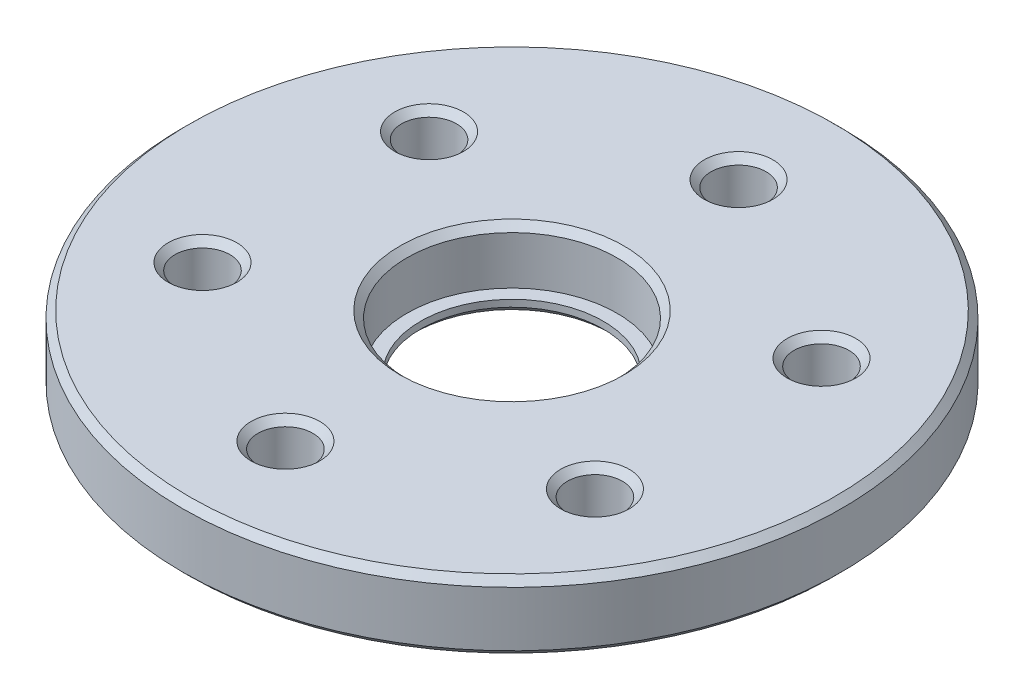
ISO-10303-21;
HEADER;
FILE_DESCRIPTION(('STEP AP214'),'2;1');
FILE_NAME('part.step','',(''),(''),'','','');
FILE_SCHEMA(('AUTOMOTIVE_DESIGN { 1 0 10303 214 1 1 1 1 }'));
ENDSEC;
DATA;
#1=APPLICATION_CONTEXT('core data for automotive mechanical design processes');
#2=APPLICATION_PROTOCOL_DEFINITION('international standard','automotive_design',2000,#1);
#3=PRODUCT_CONTEXT('',#1,'mechanical');
#4=PRODUCT('Part','Part','',(#3));
#5=PRODUCT_RELATED_PRODUCT_CATEGORY('part','',(#4));
#6=PRODUCT_DEFINITION_FORMATION('','',#4);
#7=PRODUCT_DEFINITION_CONTEXT('part definition',#1,'design');
#8=PRODUCT_DEFINITION('design','',#6,#7);
#9=PRODUCT_DEFINITION_SHAPE('','',#8);
#10=(LENGTH_UNIT() NAMED_UNIT(*) SI_UNIT(.MILLI.,.METRE.));
#11=(NAMED_UNIT(*) PLANE_ANGLE_UNIT() SI_UNIT($,.RADIAN.));
#12=(NAMED_UNIT(*) SI_UNIT($,.STERADIAN.) SOLID_ANGLE_UNIT());
#13=UNCERTAINTY_MEASURE_WITH_UNIT(LENGTH_MEASURE(1.E-05),#10,'distance_accuracy_value','');
#14=(GEOMETRIC_REPRESENTATION_CONTEXT(3) GLOBAL_UNCERTAINTY_ASSIGNED_CONTEXT((#13)) GLOBAL_UNIT_ASSIGNED_CONTEXT((#10,
#11,#12)) REPRESENTATION_CONTEXT('',''));
#15=CARTESIAN_POINT('',(0.,0.,0.));
#16=DIRECTION('',(0.,0.,1.));
#17=DIRECTION('',(1.,0.,0.));
#18=AXIS2_PLACEMENT_3D('',#15,#16,#17);
#19=CARTESIAN_POINT('',(0.,4.,0.));
#20=DIRECTION('',(0.,1.,0.));
#21=DIRECTION('',(0.,0.,1.));
#22=AXIS2_PLACEMENT_3D('',#19,#20,#21);
#23=PLANE('',#22);
#24=CARTESIAN_POINT('',(0.,4.,0.));
#25=DIRECTION('',(0.,1.,0.));
#26=DIRECTION('',(0.,0.,1.));
#27=AXIS2_PLACEMENT_3D('',#24,#25,#26);
#28=CIRCLE('',#27,8.15000000000001);
#29=CARTESIAN_POINT('',(0.,4.,8.15000000000001));
#30=VERTEX_POINT('',#29);
#31=EDGE_CURVE('E10',#30,#30,#28,.F.);
#32=ORIENTED_EDGE('',*,*,#31,.T.);
#33=EDGE_LOOP('',(#32));
#34=FACE_BOUND('',#33,.T.);
#35=CARTESIAN_POINT('',(0.,4.,0.));
#36=DIRECTION('',(0.,1.,0.));
#37=DIRECTION('',(0.,0.,1.));
#38=AXIS2_PLACEMENT_3D('',#35,#36,#37);
#39=CIRCLE('',#38,23.5);
#40=CARTESIAN_POINT('',(0.,4.,23.5));
#41=VERTEX_POINT('',#40);
#42=EDGE_CURVE('E47',#41,#41,#39,.T.);
#43=ORIENTED_EDGE('',*,*,#42,.T.);
#44=EDGE_LOOP('',(#43));
#45=FACE_BOUND('',#44,.T.);
#46=CARTESIAN_POINT('',(0.,4.,-16.5));
#47=DIRECTION('',(0.,1.,0.));
#48=DIRECTION('',(0.,0.,1.));
#49=AXIS2_PLACEMENT_3D('',#46,#47,#48);
#50=CIRCLE('',#49,2.5);
#51=CARTESIAN_POINT('',(0.,4.,-14.));
#52=VERTEX_POINT('',#51);
#53=EDGE_CURVE('E51',#52,#52,#50,.F.);
#54=ORIENTED_EDGE('',*,*,#53,.T.);
#55=EDGE_LOOP('',(#54));
#56=FACE_BOUND('',#55,.T.);
#57=CARTESIAN_POINT('',(-14.2894191624433,4.,-8.24999999999997));
#58=DIRECTION('',(0.,1.,0.));
#59=DIRECTION('',(0.,0.,1.));
#60=AXIS2_PLACEMENT_3D('',#57,#58,#59);
#61=CIRCLE('',#60,2.49999999999999);
#62=CARTESIAN_POINT('',(-14.2894191624433,4.,-5.74999999999998));
#63=VERTEX_POINT('',#62);
#64=EDGE_CURVE('E55',#63,#63,#61,.F.);
#65=ORIENTED_EDGE('',*,*,#64,.T.);
#66=EDGE_LOOP('',(#65));
#67=FACE_BOUND('',#66,.T.);
#68=CARTESIAN_POINT('',(-14.2894191624432,4.,8.25000000000007));
#69=DIRECTION('',(0.,1.,0.));
#70=DIRECTION('',(0.,0.,1.));
#71=AXIS2_PLACEMENT_3D('',#68,#69,#70);
#72=CIRCLE('',#71,2.50000000000001);
#73=CARTESIAN_POINT('',(-14.2894191624432,4.,10.7500000000001));
#74=VERTEX_POINT('',#73);
#75=EDGE_CURVE('E60',#74,#74,#72,.F.);
#76=ORIENTED_EDGE('',*,*,#75,.T.);
#77=EDGE_LOOP('',(#76));
#78=FACE_BOUND('',#77,.T.);
#79=CARTESIAN_POINT('',(0.,4.,16.5));
#80=DIRECTION('',(0.,1.,0.));
#81=DIRECTION('',(0.,0.,1.));
#82=AXIS2_PLACEMENT_3D('',#79,#80,#81);
#83=CIRCLE('',#82,2.5);
#84=CARTESIAN_POINT('',(0.,4.,19.));
#85=VERTEX_POINT('',#84);
#86=EDGE_CURVE('E63',#85,#85,#83,.F.);
#87=ORIENTED_EDGE('',*,*,#86,.T.);
#88=EDGE_LOOP('',(#87));
#89=FACE_BOUND('',#88,.T.);
#90=CARTESIAN_POINT('',(14.2894191624433,4.,8.24999999999987));
#91=DIRECTION('',(0.,1.,0.));
#92=DIRECTION('',(0.,0.,1.));
#93=AXIS2_PLACEMENT_3D('',#90,#91,#92);
#94=CIRCLE('',#93,2.50000000000002);
#95=CARTESIAN_POINT('',(14.2894191624433,4.,10.7499999999999));
#96=VERTEX_POINT('',#95);
#97=EDGE_CURVE('E66',#96,#96,#94,.F.);
#98=ORIENTED_EDGE('',*,*,#97,.T.);
#99=EDGE_LOOP('',(#98));
#100=FACE_BOUND('',#99,.T.);
#101=CARTESIAN_POINT('',(14.2894191624431,4.,-8.25000000000017));
#102=DIRECTION('',(0.,1.,0.));
#103=DIRECTION('',(0.,0.,1.));
#104=AXIS2_PLACEMENT_3D('',#101,#102,#103);
#105=CIRCLE('',#104,2.50000000000002);
#106=CARTESIAN_POINT('',(14.2894191624431,4.,-5.75000000000015));
#107=VERTEX_POINT('',#106);
#108=EDGE_CURVE('E69',#107,#107,#105,.F.);
#109=ORIENTED_EDGE('',*,*,#108,.T.);
#110=EDGE_LOOP('',(#109));
#111=FACE_BOUND('',#110,.T.);
#112=ADVANCED_FACE('F39',(#34,#45,#56,#67,#78,#89,#100,#111),#23,.T.);
#113=CARTESIAN_POINT('',(0.,4.,0.));
#114=DIRECTION('',(0.,-1.,0.));
#115=DIRECTION('',(0.,0.,-1.));
#116=AXIS2_PLACEMENT_3D('',#113,#114,#115);
#117=CYLINDRICAL_SURFACE('',#116,24.);
#118=CARTESIAN_POINT('',(0.,-0.499999999999996,0.));
#119=DIRECTION('',(0.,1.,0.));
#120=DIRECTION('',(0.,0.,1.));
#121=AXIS2_PLACEMENT_3D('',#118,#119,#120);
#122=CIRCLE('',#121,24.);
#123=CARTESIAN_POINT('',(0.,-0.499999999999996,24.));
#124=VERTEX_POINT('',#123);
#125=EDGE_CURVE('E138',#124,#124,#122,.T.);
#126=ORIENTED_EDGE('',*,*,#125,.T.);
#127=EDGE_LOOP('',(#126));
#128=FACE_BOUND('',#127,.T.);
#129=CARTESIAN_POINT('',(0.,3.5,0.));
#130=DIRECTION('',(0.,1.,0.));
#131=DIRECTION('',(0.,0.,1.));
#132=AXIS2_PLACEMENT_3D('',#129,#130,#131);
#133=CIRCLE('',#132,24.);
#134=CARTESIAN_POINT('',(0.,3.5,24.));
#135=VERTEX_POINT('',#134);
#136=EDGE_CURVE('E141',#135,#135,#133,.F.);
#137=ORIENTED_EDGE('',*,*,#136,.T.);
#138=EDGE_LOOP('',(#137));
#139=FACE_BOUND('',#138,.T.);
#140=ADVANCED_FACE('F164',(#128,#139),#117,.T.);
#141=CARTESIAN_POINT('',(0.,4.,0.));
#142=DIRECTION('',(0.,-1.,0.));
#143=DIRECTION('',(0.,0.,-1.));
#144=AXIS2_PLACEMENT_3D('',#141,#142,#143);
#145=CYLINDRICAL_SURFACE('',#144,7.65);
#146=CARTESIAN_POINT('',(0.,3.5,0.));
#147=DIRECTION('',(0.,1.,0.));
#148=DIRECTION('',(0.,0.,1.));
#149=AXIS2_PLACEMENT_3D('',#146,#147,#148);
#150=CIRCLE('',#149,7.65);
#151=CARTESIAN_POINT('',(0.,3.5,7.65));
#152=VERTEX_POINT('',#151);
#153=EDGE_CURVE('E72',#152,#152,#150,.T.);
#154=ORIENTED_EDGE('',*,*,#153,.T.);
#155=EDGE_LOOP('',(#154));
#156=FACE_BOUND('',#155,.T.);
#157=CARTESIAN_POINT('',(0.,0.,0.));
#158=DIRECTION('',(0.,1.,0.));
#159=DIRECTION('',(0.,0.,1.));
#160=AXIS2_PLACEMENT_3D('',#157,#158,#159);
#161=CIRCLE('',#160,7.65);
#162=CARTESIAN_POINT('',(0.,0.,7.65));
#163=VERTEX_POINT('',#162);
#164=EDGE_CURVE('E144',#163,#163,#161,.T.);
#165=ORIENTED_EDGE('',*,*,#164,.F.);
#166=EDGE_LOOP('',(#165));
#167=FACE_BOUND('',#166,.T.);
#168=ADVANCED_FACE('F161',(#156,#167),#145,.F.);
#169=CARTESIAN_POINT('',(0.,0.,-16.5));
#170=DIRECTION('',(0.,1.,0.));
#171=DIRECTION('',(0.,0.,1.));
#172=AXIS2_PLACEMENT_3D('',#169,#170,#171);
#173=CYLINDRICAL_SURFACE('',#172,2.);
#174=CARTESIAN_POINT('',(0.,-0.500000000000005,-16.5));
#175=DIRECTION('',(0.,1.,0.));
#176=DIRECTION('',(0.,0.,1.));
#177=AXIS2_PLACEMENT_3D('',#174,#175,#176);
#178=CIRCLE('',#177,2.);
#179=CARTESIAN_POINT('',(0.,-0.500000000000005,-14.5));
#180=VERTEX_POINT('',#179);
#181=EDGE_CURVE('E81',#180,#180,#178,.F.);
#182=ORIENTED_EDGE('',*,*,#181,.T.);
#183=EDGE_LOOP('',(#182));
#184=FACE_BOUND('',#183,.T.);
#185=CARTESIAN_POINT('',(0.,3.50000000000001,-16.5));
#186=DIRECTION('',(0.,1.,0.));
#187=DIRECTION('',(0.,0.,1.));
#188=AXIS2_PLACEMENT_3D('',#185,#186,#187);
#189=CIRCLE('',#188,2.);
#190=CARTESIAN_POINT('',(0.,3.50000000000001,-14.5));
#191=VERTEX_POINT('',#190);
#192=EDGE_CURVE('E84',#191,#191,#189,.T.);
#193=ORIENTED_EDGE('',*,*,#192,.T.);
#194=EDGE_LOOP('',(#193));
#195=FACE_BOUND('',#194,.T.);
#196=ADVANCED_FACE('F163',(#184,#195),#173,.F.);
#197=CARTESIAN_POINT('',(-14.2894191624433,0.,-8.24999999999997));
#198=DIRECTION('',(0.,1.,0.));
#199=DIRECTION('',(0.,0.,1.));
#200=AXIS2_PLACEMENT_3D('',#197,#198,#199);
#201=CYLINDRICAL_SURFACE('',#200,2.);
#202=CARTESIAN_POINT('',(-14.2894191624433,-0.499999999999999,-8.24999999999997));
#203=DIRECTION('',(0.,1.,0.));
#204=DIRECTION('',(0.,0.,1.));
#205=AXIS2_PLACEMENT_3D('',#202,#203,#204);
#206=CIRCLE('',#205,2.);
#207=CARTESIAN_POINT('',(-14.2894191624433,-0.499999999999999,-6.24999999999997));
#208=VERTEX_POINT('',#207);
#209=EDGE_CURVE('E75',#208,#208,#206,.F.);
#210=ORIENTED_EDGE('',*,*,#209,.T.);
#211=EDGE_LOOP('',(#210));
#212=FACE_BOUND('',#211,.T.);
#213=CARTESIAN_POINT('',(-14.2894191624433,3.50000000000001,-8.24999999999997));
#214=DIRECTION('',(0.,1.,0.));
#215=DIRECTION('',(0.,0.,1.));
#216=AXIS2_PLACEMENT_3D('',#213,#214,#215);
#217=CIRCLE('',#216,2.);
#218=CARTESIAN_POINT('',(-14.2894191624433,3.50000000000001,-6.24999999999997));
#219=VERTEX_POINT('',#218);
#220=EDGE_CURVE('E78',#219,#219,#217,.T.);
#221=ORIENTED_EDGE('',*,*,#220,.T.);
#222=EDGE_LOOP('',(#221));
#223=FACE_BOUND('',#222,.T.);
#224=ADVANCED_FACE('F171',(#212,#223),#201,.F.);
#225=CARTESIAN_POINT('',(-14.2894191624432,0.,8.25000000000007));
#226=DIRECTION('',(0.,1.,0.));
#227=DIRECTION('',(0.,0.,1.));
#228=AXIS2_PLACEMENT_3D('',#225,#226,#227);
#229=CYLINDRICAL_SURFACE('',#228,2.);
#230=CARTESIAN_POINT('',(-14.2894191624432,-0.499999999999985,8.25000000000007));
#231=DIRECTION('',(0.,1.,0.));
#232=DIRECTION('',(0.,0.,1.));
#233=AXIS2_PLACEMENT_3D('',#230,#231,#232);
#234=CIRCLE('',#233,2.);
#235=CARTESIAN_POINT('',(-14.2894191624432,-0.499999999999985,10.2500000000001));
#236=VERTEX_POINT('',#235);
#237=EDGE_CURVE('E108',#236,#236,#234,.F.);
#238=ORIENTED_EDGE('',*,*,#237,.T.);
#239=EDGE_LOOP('',(#238));
#240=FACE_BOUND('',#239,.T.);
#241=CARTESIAN_POINT('',(-14.2894191624432,3.5,8.25000000000007));
#242=DIRECTION('',(0.,1.,0.));
#243=DIRECTION('',(0.,0.,1.));
#244=AXIS2_PLACEMENT_3D('',#241,#242,#243);
#245=CIRCLE('',#244,2.);
#246=CARTESIAN_POINT('',(-14.2894191624432,3.5,10.2500000000001));
#247=VERTEX_POINT('',#246);
#248=EDGE_CURVE('E111',#247,#247,#245,.T.);
#249=ORIENTED_EDGE('',*,*,#248,.T.);
#250=EDGE_LOOP('',(#249));
#251=FACE_BOUND('',#250,.T.);
#252=ADVANCED_FACE('F303',(#240,#251),#229,.F.);
#253=CARTESIAN_POINT('',(0.,0.,16.5));
#254=DIRECTION('',(0.,1.,0.));
#255=DIRECTION('',(0.,0.,1.));
#256=AXIS2_PLACEMENT_3D('',#253,#254,#255);
#257=CYLINDRICAL_SURFACE('',#256,2.);
#258=CARTESIAN_POINT('',(0.,-0.499999999999999,16.5));
#259=DIRECTION('',(0.,1.,0.));
#260=DIRECTION('',(0.,0.,1.));
#261=AXIS2_PLACEMENT_3D('',#258,#259,#260);
#262=CIRCLE('',#261,2.);
#263=CARTESIAN_POINT('',(0.,-0.499999999999999,18.5));
#264=VERTEX_POINT('',#263);
#265=EDGE_CURVE('E99',#264,#264,#262,.F.);
#266=ORIENTED_EDGE('',*,*,#265,.T.);
#267=EDGE_LOOP('',(#266));
#268=FACE_BOUND('',#267,.T.);
#269=CARTESIAN_POINT('',(0.,3.50000000000001,16.5));
#270=DIRECTION('',(0.,1.,0.));
#271=DIRECTION('',(0.,0.,1.));
#272=AXIS2_PLACEMENT_3D('',#269,#270,#271);
#273=CIRCLE('',#272,2.);
#274=CARTESIAN_POINT('',(0.,3.50000000000001,18.5));
#275=VERTEX_POINT('',#274);
#276=EDGE_CURVE('E102',#275,#275,#273,.T.);
#277=ORIENTED_EDGE('',*,*,#276,.T.);
#278=EDGE_LOOP('',(#277));
#279=FACE_BOUND('',#278,.T.);
#280=ADVANCED_FACE('F294',(#268,#279),#257,.F.);
#281=CARTESIAN_POINT('',(14.2894191624433,0.,8.24999999999987));
#282=DIRECTION('',(0.,1.,0.));
#283=DIRECTION('',(0.,0.,1.));
#284=AXIS2_PLACEMENT_3D('',#281,#282,#283);
#285=CYLINDRICAL_SURFACE('',#284,2.);
#286=CARTESIAN_POINT('',(14.2894191624433,-0.499999999999999,8.24999999999987));
#287=DIRECTION('',(0.,1.,0.));
#288=DIRECTION('',(0.,0.,1.));
#289=AXIS2_PLACEMENT_3D('',#286,#287,#288);
#290=CIRCLE('',#289,2.);
#291=CARTESIAN_POINT('',(14.2894191624433,-0.499999999999999,10.2499999999999));
#292=VERTEX_POINT('',#291);
#293=EDGE_CURVE('E93',#292,#292,#290,.F.);
#294=ORIENTED_EDGE('',*,*,#293,.T.);
#295=EDGE_LOOP('',(#294));
#296=FACE_BOUND('',#295,.T.);
#297=CARTESIAN_POINT('',(14.2894191624433,3.49999999999998,8.24999999999987));
#298=DIRECTION('',(0.,1.,0.));
#299=DIRECTION('',(0.,0.,1.));
#300=AXIS2_PLACEMENT_3D('',#297,#298,#299);
#301=CIRCLE('',#300,2.);
#302=CARTESIAN_POINT('',(14.2894191624433,3.49999999999998,10.2499999999999));
#303=VERTEX_POINT('',#302);
#304=EDGE_CURVE('E96',#303,#303,#301,.T.);
#305=ORIENTED_EDGE('',*,*,#304,.T.);
#306=EDGE_LOOP('',(#305));
#307=FACE_BOUND('',#306,.T.);
#308=ADVANCED_FACE('F292',(#296,#307),#285,.F.);
#309=CARTESIAN_POINT('',(14.2894191624431,0.,-8.25000000000017));
#310=DIRECTION('',(0.,1.,0.));
#311=DIRECTION('',(0.,0.,1.));
#312=AXIS2_PLACEMENT_3D('',#309,#310,#311);
#313=CYLINDRICAL_SURFACE('',#312,2.);
#314=CARTESIAN_POINT('',(14.2894191624431,-0.499999999999999,-8.25000000000017));
#315=DIRECTION('',(0.,1.,0.));
#316=DIRECTION('',(0.,0.,1.));
#317=AXIS2_PLACEMENT_3D('',#314,#315,#316);
#318=CIRCLE('',#317,2.);
#319=CARTESIAN_POINT('',(14.2894191624431,-0.499999999999999,-6.25000000000017));
#320=VERTEX_POINT('',#319);
#321=EDGE_CURVE('E87',#320,#320,#318,.F.);
#322=ORIENTED_EDGE('',*,*,#321,.T.);
#323=EDGE_LOOP('',(#322));
#324=FACE_BOUND('',#323,.T.);
#325=CARTESIAN_POINT('',(14.2894191624431,3.49999999999999,-8.25000000000017));
#326=DIRECTION('',(0.,1.,0.));
#327=DIRECTION('',(0.,0.,1.));
#328=AXIS2_PLACEMENT_3D('',#325,#326,#327);
#329=CIRCLE('',#328,2.);
#330=CARTESIAN_POINT('',(14.2894191624431,3.49999999999999,-6.25000000000017));
#331=VERTEX_POINT('',#330);
#332=EDGE_CURVE('E90',#331,#331,#329,.T.);
#333=ORIENTED_EDGE('',*,*,#332,.T.);
#334=EDGE_LOOP('',(#333));
#335=FACE_BOUND('',#334,.T.);
#336=ADVANCED_FACE('F157',(#324,#335),#313,.F.);
#337=CARTESIAN_POINT('',(0.,0.,0.));
#338=DIRECTION('',(0.,1.,0.));
#339=DIRECTION('',(0.,0.,1.));
#340=AXIS2_PLACEMENT_3D('',#337,#338,#339);
#341=PLANE('',#340);
#342=CARTESIAN_POINT('',(0.,0.,0.));
#343=DIRECTION('',(0.,1.,0.));
#344=DIRECTION('',(0.,0.,1.));
#345=AXIS2_PLACEMENT_3D('',#342,#343,#344);
#346=CIRCLE('',#345,6.65);
#347=CARTESIAN_POINT('',(0.,0.,6.65));
#348=VERTEX_POINT('',#347);
#349=EDGE_CURVE('E147',#348,#348,#346,.T.);
#350=ORIENTED_EDGE('',*,*,#349,.F.);
#351=EDGE_LOOP('',(#350));
#352=FACE_BOUND('',#351,.T.);
#353=ORIENTED_EDGE('',*,*,#164,.T.);
#354=EDGE_LOOP('',(#353));
#355=FACE_BOUND('',#354,.T.);
#356=ADVANCED_FACE('F153',(#352,#355),#341,.T.);
#357=CARTESIAN_POINT('',(0.,-1.,0.));
#358=DIRECTION('',(0.,1.,0.));
#359=DIRECTION('',(0.,0.,1.));
#360=AXIS2_PLACEMENT_3D('',#357,#358,#359);
#361=PLANE('',#360);
#362=CARTESIAN_POINT('',(0.,-1.,0.));
#363=DIRECTION('',(0.,1.,0.));
#364=DIRECTION('',(0.,0.,1.));
#365=AXIS2_PLACEMENT_3D('',#362,#363,#364);
#366=CIRCLE('',#365,23.5);
#367=CARTESIAN_POINT('',(0.,-1.,23.5));
#368=VERTEX_POINT('',#367);
#369=EDGE_CURVE('E114',#368,#368,#366,.F.);
#370=ORIENTED_EDGE('',*,*,#369,.T.);
#371=EDGE_LOOP('',(#370));
#372=FACE_BOUND('',#371,.T.);
#373=CARTESIAN_POINT('',(-14.2894191624432,-1.,8.25000000000007));
#374=DIRECTION('',(0.,1.,0.));
#375=DIRECTION('',(0.,0.,1.));
#376=AXIS2_PLACEMENT_3D('',#373,#374,#375);
#377=CIRCLE('',#376,2.50000000000002);
#378=CARTESIAN_POINT('',(-14.2894191624432,-1.,10.7500000000001));
#379=VERTEX_POINT('',#378);
#380=EDGE_CURVE('E117',#379,#379,#377,.T.);
#381=ORIENTED_EDGE('',*,*,#380,.T.);
#382=EDGE_LOOP('',(#381));
#383=FACE_BOUND('',#382,.T.);
#384=CARTESIAN_POINT('',(0.,-1.,0.));
#385=DIRECTION('',(0.,1.,0.));
#386=DIRECTION('',(0.,0.,1.));
#387=AXIS2_PLACEMENT_3D('',#384,#385,#386);
#388=CIRCLE('',#387,7.15);
#389=CARTESIAN_POINT('',(0.,-1.,7.15));
#390=VERTEX_POINT('',#389);
#391=EDGE_CURVE('E120',#390,#390,#388,.T.);
#392=ORIENTED_EDGE('',*,*,#391,.T.);
#393=EDGE_LOOP('',(#392));
#394=FACE_BOUND('',#393,.T.);
#395=CARTESIAN_POINT('',(0.,-1.,16.5));
#396=DIRECTION('',(0.,1.,0.));
#397=DIRECTION('',(0.,0.,1.));
#398=AXIS2_PLACEMENT_3D('',#395,#396,#397);
#399=CIRCLE('',#398,2.5);
#400=CARTESIAN_POINT('',(0.,-1.,19.));
#401=VERTEX_POINT('',#400);
#402=EDGE_CURVE('E123',#401,#401,#399,.T.);
#403=ORIENTED_EDGE('',*,*,#402,.T.);
#404=EDGE_LOOP('',(#403));
#405=FACE_BOUND('',#404,.T.);
#406=CARTESIAN_POINT('',(14.2894191624433,-1.,8.24999999999987));
#407=DIRECTION('',(0.,1.,0.));
#408=DIRECTION('',(0.,0.,1.));
#409=AXIS2_PLACEMENT_3D('',#406,#407,#408);
#410=CIRCLE('',#409,2.5);
#411=CARTESIAN_POINT('',(14.2894191624433,-1.,10.7499999999999));
#412=VERTEX_POINT('',#411);
#413=EDGE_CURVE('E126',#412,#412,#410,.T.);
#414=ORIENTED_EDGE('',*,*,#413,.T.);
#415=EDGE_LOOP('',(#414));
#416=FACE_BOUND('',#415,.T.);
#417=CARTESIAN_POINT('',(14.2894191624431,-1.,-8.25000000000017));
#418=DIRECTION('',(0.,1.,0.));
#419=DIRECTION('',(0.,0.,1.));
#420=AXIS2_PLACEMENT_3D('',#417,#418,#419);
#421=CIRCLE('',#420,2.5);
#422=CARTESIAN_POINT('',(14.2894191624431,-1.,-5.75000000000016));
#423=VERTEX_POINT('',#422);
#424=EDGE_CURVE('E129',#423,#423,#421,.T.);
#425=ORIENTED_EDGE('',*,*,#424,.T.);
#426=EDGE_LOOP('',(#425));
#427=FACE_BOUND('',#426,.T.);
#428=CARTESIAN_POINT('',(0.,-1.,-16.5));
#429=DIRECTION('',(0.,1.,0.));
#430=DIRECTION('',(0.,0.,1.));
#431=AXIS2_PLACEMENT_3D('',#428,#429,#430);
#432=CIRCLE('',#431,2.49999999999998);
#433=CARTESIAN_POINT('',(0.,-1.,-14.));
#434=VERTEX_POINT('',#433);
#435=EDGE_CURVE('E132',#434,#434,#432,.T.);
#436=ORIENTED_EDGE('',*,*,#435,.T.);
#437=EDGE_LOOP('',(#436));
#438=FACE_BOUND('',#437,.T.);
#439=CARTESIAN_POINT('',(-14.2894191624433,-1.,-8.24999999999997));
#440=DIRECTION('',(0.,1.,0.));
#441=DIRECTION('',(0.,0.,1.));
#442=AXIS2_PLACEMENT_3D('',#439,#440,#441);
#443=CIRCLE('',#442,2.5);
#444=CARTESIAN_POINT('',(-14.2894191624433,-1.,-5.74999999999997));
#445=VERTEX_POINT('',#444);
#446=EDGE_CURVE('E135',#445,#445,#443,.T.);
#447=ORIENTED_EDGE('',*,*,#446,.T.);
#448=EDGE_LOOP('',(#447));
#449=FACE_BOUND('',#448,.T.);
#450=ADVANCED_FACE('F156',(#372,#383,#394,#405,#416,#427,#438,#449),#361,.F.);
#451=CARTESIAN_POINT('',(0.,-1.,0.));
#452=DIRECTION('',(0.,1.,0.));
#453=DIRECTION('',(0.,0.,1.));
#454=AXIS2_PLACEMENT_3D('',#451,#452,#453);
#455=CYLINDRICAL_SURFACE('',#454,6.65);
#456=CARTESIAN_POINT('',(0.,-0.499999999999992,0.));
#457=DIRECTION('',(0.,1.,0.));
#458=DIRECTION('',(0.,0.,1.));
#459=AXIS2_PLACEMENT_3D('',#456,#457,#458);
#460=CIRCLE('',#459,6.65);
#461=CARTESIAN_POINT('',(0.,-0.499999999999992,6.65));
#462=VERTEX_POINT('',#461);
#463=EDGE_CURVE('E105',#462,#462,#460,.F.);
#464=ORIENTED_EDGE('',*,*,#463,.T.);
#465=EDGE_LOOP('',(#464));
#466=FACE_BOUND('',#465,.T.);
#467=ORIENTED_EDGE('',*,*,#349,.T.);
#468=EDGE_LOOP('',(#467));
#469=FACE_BOUND('',#468,.T.);
#470=ADVANCED_FACE('F151',(#466,#469),#455,.F.);
#471=CARTESIAN_POINT('',(0.,-0.499999999999996,0.));
#472=DIRECTION('',(0.,1.,0.));
#473=DIRECTION('',(0.,0.,1.));
#474=AXIS2_PLACEMENT_3D('',#471,#472,#473);
#475=CONICAL_SURFACE('',#474,24.,0.785398163397448);
#476=ORIENTED_EDGE('',*,*,#369,.F.);
#477=EDGE_LOOP('',(#476));
#478=FACE_BOUND('',#477,.T.);
#479=ORIENTED_EDGE('',*,*,#125,.F.);
#480=EDGE_LOOP('',(#479));
#481=FACE_BOUND('',#480,.T.);
#482=ADVANCED_FACE('F182',(#478,#481),#475,.T.);
#483=CARTESIAN_POINT('',(-14.2894191624432,-1.,8.25000000000007));
#484=DIRECTION('',(0.,-1.,0.));
#485=DIRECTION('',(0.,0.,-1.));
#486=AXIS2_PLACEMENT_3D('',#483,#484,#485);
#487=CONICAL_SURFACE('',#486,2.50000000000002,0.785398163397448);
#488=ORIENTED_EDGE('',*,*,#237,.F.);
#489=EDGE_LOOP('',(#488));
#490=FACE_BOUND('',#489,.T.);
#491=ORIENTED_EDGE('',*,*,#380,.F.);
#492=EDGE_LOOP('',(#491));
#493=FACE_BOUND('',#492,.T.);
#494=ADVANCED_FACE('F188',(#490,#493),#487,.F.);
#495=CARTESIAN_POINT('',(0.,-1.,0.));
#496=DIRECTION('',(0.,-1.,0.));
#497=DIRECTION('',(0.,0.,-1.));
#498=AXIS2_PLACEMENT_3D('',#495,#496,#497);
#499=CONICAL_SURFACE('',#498,7.15,0.785398163397443);
#500=ORIENTED_EDGE('',*,*,#463,.F.);
#501=EDGE_LOOP('',(#500));
#502=FACE_BOUND('',#501,.T.);
#503=ORIENTED_EDGE('',*,*,#391,.F.);
#504=EDGE_LOOP('',(#503));
#505=FACE_BOUND('',#504,.T.);
#506=ADVANCED_FACE('F195',(#502,#505),#499,.F.);
#507=CARTESIAN_POINT('',(0.,-1.,16.5));
#508=DIRECTION('',(0.,-1.,0.));
#509=DIRECTION('',(0.,0.,-1.));
#510=AXIS2_PLACEMENT_3D('',#507,#508,#509);
#511=CONICAL_SURFACE('',#510,2.5,0.785398163397448);
#512=ORIENTED_EDGE('',*,*,#265,.F.);
#513=EDGE_LOOP('',(#512));
#514=FACE_BOUND('',#513,.T.);
#515=ORIENTED_EDGE('',*,*,#402,.F.);
#516=EDGE_LOOP('',(#515));
#517=FACE_BOUND('',#516,.T.);
#518=ADVANCED_FACE('F202',(#514,#517),#511,.F.);
#519=CARTESIAN_POINT('',(14.2894191624433,-1.,8.24999999999987));
#520=DIRECTION('',(0.,-1.,0.));
#521=DIRECTION('',(0.,0.,-1.));
#522=AXIS2_PLACEMENT_3D('',#519,#520,#521);
#523=CONICAL_SURFACE('',#522,2.5,0.785398163397448);
#524=ORIENTED_EDGE('',*,*,#293,.F.);
#525=EDGE_LOOP('',(#524));
#526=FACE_BOUND('',#525,.T.);
#527=ORIENTED_EDGE('',*,*,#413,.F.);
#528=EDGE_LOOP('',(#527));
#529=FACE_BOUND('',#528,.T.);
#530=ADVANCED_FACE('F209',(#526,#529),#523,.F.);
#531=CARTESIAN_POINT('',(14.2894191624431,-1.,-8.25000000000017));
#532=DIRECTION('',(0.,-1.,0.));
#533=DIRECTION('',(0.,0.,-1.));
#534=AXIS2_PLACEMENT_3D('',#531,#532,#533);
#535=CONICAL_SURFACE('',#534,2.5,0.785398163397448);
#536=ORIENTED_EDGE('',*,*,#321,.F.);
#537=EDGE_LOOP('',(#536));
#538=FACE_BOUND('',#537,.T.);
#539=ORIENTED_EDGE('',*,*,#424,.F.);
#540=EDGE_LOOP('',(#539));
#541=FACE_BOUND('',#540,.T.);
#542=ADVANCED_FACE('F216',(#538,#541),#535,.F.);
#543=CARTESIAN_POINT('',(0.,-1.,-16.5));
#544=DIRECTION('',(0.,-1.,0.));
#545=DIRECTION('',(0.,0.,-1.));
#546=AXIS2_PLACEMENT_3D('',#543,#544,#545);
#547=CONICAL_SURFACE('',#546,2.49999999999998,0.785398163397434);
#548=ORIENTED_EDGE('',*,*,#181,.F.);
#549=EDGE_LOOP('',(#548));
#550=FACE_BOUND('',#549,.T.);
#551=ORIENTED_EDGE('',*,*,#435,.F.);
#552=EDGE_LOOP('',(#551));
#553=FACE_BOUND('',#552,.T.);
#554=ADVANCED_FACE('F223',(#550,#553),#547,.F.);
#555=CARTESIAN_POINT('',(-14.2894191624433,-1.,-8.24999999999997));
#556=DIRECTION('',(0.,-1.,0.));
#557=DIRECTION('',(0.,0.,-1.));
#558=AXIS2_PLACEMENT_3D('',#555,#556,#557);
#559=CONICAL_SURFACE('',#558,2.5,0.785398163397447);
#560=ORIENTED_EDGE('',*,*,#209,.F.);
#561=EDGE_LOOP('',(#560));
#562=FACE_BOUND('',#561,.T.);
#563=ORIENTED_EDGE('',*,*,#446,.F.);
#564=EDGE_LOOP('',(#563));
#565=FACE_BOUND('',#564,.T.);
#566=ADVANCED_FACE('F230',(#562,#565),#559,.F.);
#567=CARTESIAN_POINT('',(0.,3.5,0.));
#568=DIRECTION('',(0.,1.,0.));
#569=DIRECTION('',(0.,0.,1.));
#570=AXIS2_PLACEMENT_3D('',#567,#568,#569);
#571=CONICAL_SURFACE('',#570,7.65,0.785398163397457);
#572=ORIENTED_EDGE('',*,*,#31,.F.);
#573=EDGE_LOOP('',(#572));
#574=FACE_BOUND('',#573,.T.);
#575=ORIENTED_EDGE('',*,*,#153,.F.);
#576=EDGE_LOOP('',(#575));
#577=FACE_BOUND('',#576,.T.);
#578=ADVANCED_FACE('F237',(#574,#577),#571,.F.);
#579=CARTESIAN_POINT('',(0.,4.,0.));
#580=DIRECTION('',(0.,-1.,0.));
#581=DIRECTION('',(0.,0.,-1.));
#582=AXIS2_PLACEMENT_3D('',#579,#580,#581);
#583=CONICAL_SURFACE('',#582,23.5,0.785398163397445);
#584=ORIENTED_EDGE('',*,*,#136,.F.);
#585=EDGE_LOOP('',(#584));
#586=FACE_BOUND('',#585,.T.);
#587=ORIENTED_EDGE('',*,*,#42,.F.);
#588=EDGE_LOOP('',(#587));
#589=FACE_BOUND('',#588,.T.);
#590=ADVANCED_FACE('F244',(#586,#589),#583,.T.);
#591=CARTESIAN_POINT('',(0.,3.50000000000001,-16.5));
#592=DIRECTION('',(0.,1.,0.));
#593=DIRECTION('',(0.,0.,1.));
#594=AXIS2_PLACEMENT_3D('',#591,#592,#593);
#595=CONICAL_SURFACE('',#594,2.,0.785398163397448);
#596=ORIENTED_EDGE('',*,*,#53,.F.);
#597=EDGE_LOOP('',(#596));
#598=FACE_BOUND('',#597,.T.);
#599=ORIENTED_EDGE('',*,*,#192,.F.);
#600=EDGE_LOOP('',(#599));
#601=FACE_BOUND('',#600,.T.);
#602=ADVANCED_FACE('F251',(#598,#601),#595,.F.);
#603=CARTESIAN_POINT('',(-14.2894191624433,3.50000000000001,-8.24999999999997));
#604=DIRECTION('',(0.,1.,0.));
#605=DIRECTION('',(0.,0.,1.));
#606=AXIS2_PLACEMENT_3D('',#603,#604,#605);
#607=CONICAL_SURFACE('',#606,2.,0.785398163397449);
#608=ORIENTED_EDGE('',*,*,#64,.F.);
#609=EDGE_LOOP('',(#608));
#610=FACE_BOUND('',#609,.T.);
#611=ORIENTED_EDGE('',*,*,#220,.F.);
#612=EDGE_LOOP('',(#611));
#613=FACE_BOUND('',#612,.T.);
#614=ADVANCED_FACE('F258',(#610,#613),#607,.F.);
#615=CARTESIAN_POINT('',(-14.2894191624432,3.5,8.25000000000007));
#616=DIRECTION('',(0.,1.,0.));
#617=DIRECTION('',(0.,0.,1.));
#618=AXIS2_PLACEMENT_3D('',#615,#616,#617);
#619=CONICAL_SURFACE('',#618,2.,0.78539816339745);
#620=ORIENTED_EDGE('',*,*,#75,.F.);
#621=EDGE_LOOP('',(#620));
#622=FACE_BOUND('',#621,.T.);
#623=ORIENTED_EDGE('',*,*,#248,.F.);
#624=EDGE_LOOP('',(#623));
#625=FACE_BOUND('',#624,.T.);
#626=ADVANCED_FACE('F265',(#622,#625),#619,.F.);
#627=CARTESIAN_POINT('',(0.,3.50000000000001,16.5));
#628=DIRECTION('',(0.,1.,0.));
#629=DIRECTION('',(0.,0.,1.));
#630=AXIS2_PLACEMENT_3D('',#627,#628,#629);
#631=CONICAL_SURFACE('',#630,2.,0.785398163397448);
#632=ORIENTED_EDGE('',*,*,#86,.F.);
#633=EDGE_LOOP('',(#632));
#634=FACE_BOUND('',#633,.T.);
#635=ORIENTED_EDGE('',*,*,#276,.F.);
#636=EDGE_LOOP('',(#635));
#637=FACE_BOUND('',#636,.T.);
#638=ADVANCED_FACE('F272',(#634,#637),#631,.F.);
#639=CARTESIAN_POINT('',(14.2894191624433,3.49999999999998,8.24999999999987));
#640=DIRECTION('',(0.,1.,0.));
#641=DIRECTION('',(0.,0.,1.));
#642=AXIS2_PLACEMENT_3D('',#639,#640,#641);
#643=CONICAL_SURFACE('',#642,2.,0.785398163397449);
#644=ORIENTED_EDGE('',*,*,#97,.F.);
#645=EDGE_LOOP('',(#644));
#646=FACE_BOUND('',#645,.T.);
#647=ORIENTED_EDGE('',*,*,#304,.F.);
#648=EDGE_LOOP('',(#647));
#649=FACE_BOUND('',#648,.T.);
#650=ADVANCED_FACE('F278',(#646,#649),#643,.F.);
#651=CARTESIAN_POINT('',(14.2894191624431,3.49999999999999,-8.25000000000017));
#652=DIRECTION('',(0.,1.,0.));
#653=DIRECTION('',(0.,0.,1.));
#654=AXIS2_PLACEMENT_3D('',#651,#652,#653);
#655=CONICAL_SURFACE('',#654,2.,0.785398163397457);
#656=ORIENTED_EDGE('',*,*,#108,.F.);
#657=EDGE_LOOP('',(#656));
#658=FACE_BOUND('',#657,.T.);
#659=ORIENTED_EDGE('',*,*,#332,.F.);
#660=EDGE_LOOP('',(#659));
#661=FACE_BOUND('',#660,.T.);
#662=ADVANCED_FACE('F42',(#658,#661),#655,.F.);
#663=CLOSED_SHELL('',(#112,#140,#168,#196,#224,#252,#280,#308,#336,#356,#450,#470,#482,#494,
#506,#518,#530,#542,#554,#566,#578,#590,#602,#614,#626,#638,#650,#662));
#664=MANIFOLD_SOLID_BREP('B2',#663);
#665=ADVANCED_BREP_SHAPE_REPRESENTATION('',(#18,#664),#14);
#666=SHAPE_DEFINITION_REPRESENTATION(#9,#665);
ENDSEC;
END-ISO-10303-21;
